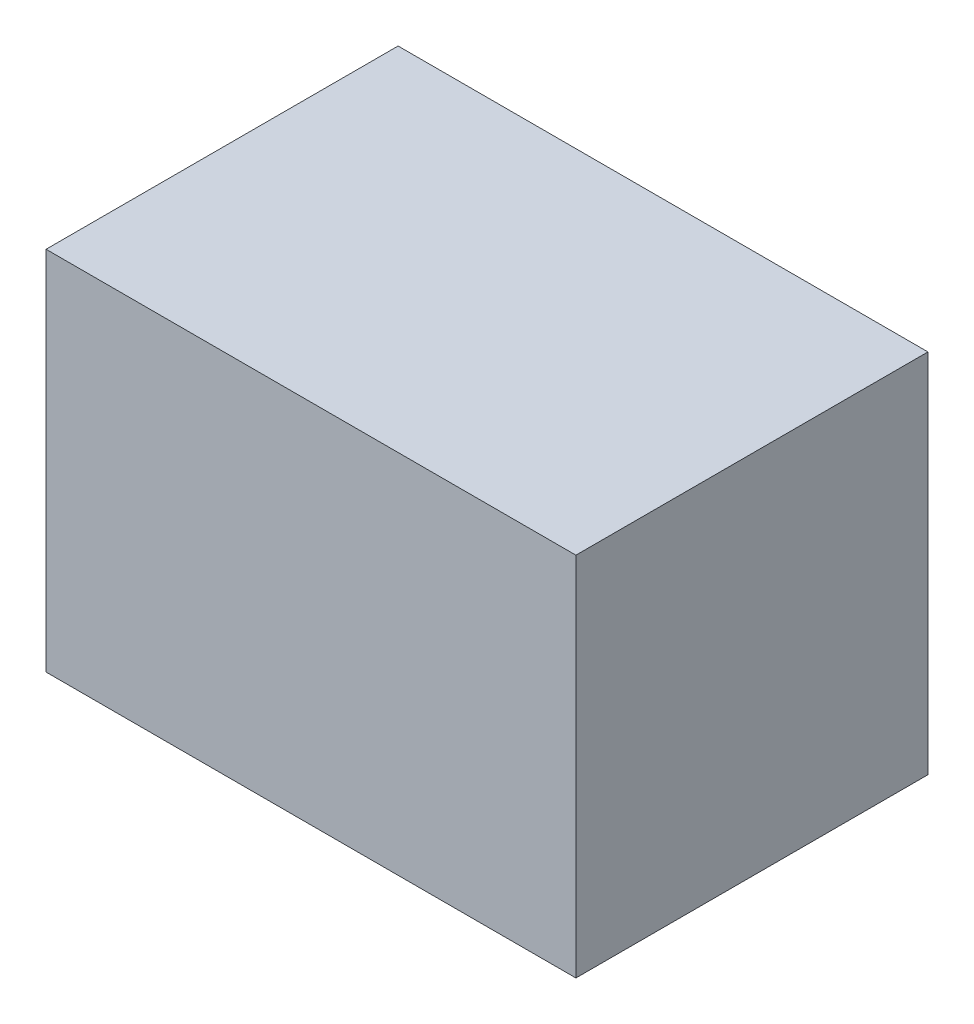
ISO-10303-21;
HEADER;
FILE_DESCRIPTION(('STEP AP214'),'2;1');
FILE_NAME('part.step','',(''),(''),'','','');
FILE_SCHEMA(('AUTOMOTIVE_DESIGN { 1 0 10303 214 1 1 1 1 }'));
ENDSEC;
DATA;
#1=APPLICATION_CONTEXT('core data for automotive mechanical design processes');
#2=APPLICATION_PROTOCOL_DEFINITION('international standard','automotive_design',2000,#1);
#3=PRODUCT_CONTEXT('',#1,'mechanical');
#4=PRODUCT('Part','Part','',(#3));
#5=PRODUCT_RELATED_PRODUCT_CATEGORY('part','',(#4));
#6=PRODUCT_DEFINITION_FORMATION('','',#4);
#7=PRODUCT_DEFINITION_CONTEXT('part definition',#1,'design');
#8=PRODUCT_DEFINITION('design','',#6,#7);
#9=PRODUCT_DEFINITION_SHAPE('','',#8);
#10=(LENGTH_UNIT() NAMED_UNIT(*) SI_UNIT(.MILLI.,.METRE.));
#11=(NAMED_UNIT(*) PLANE_ANGLE_UNIT() SI_UNIT($,.RADIAN.));
#12=(NAMED_UNIT(*) SI_UNIT($,.STERADIAN.) SOLID_ANGLE_UNIT());
#13=UNCERTAINTY_MEASURE_WITH_UNIT(LENGTH_MEASURE(1.E-05),#10,'distance_accuracy_value','');
#14=(GEOMETRIC_REPRESENTATION_CONTEXT(3) GLOBAL_UNCERTAINTY_ASSIGNED_CONTEXT((#13)) GLOBAL_UNIT_ASSIGNED_CONTEXT((#10,
#11,#12)) REPRESENTATION_CONTEXT('',''));
#15=CARTESIAN_POINT('',(0.,0.,0.));
#16=DIRECTION('',(0.,0.,1.));
#17=DIRECTION('',(1.,0.,0.));
#18=AXIS2_PLACEMENT_3D('',#15,#16,#17);
#19=CARTESIAN_POINT('',(45.1527708490236,-31.2059690423754,60.));
#20=DIRECTION('',(-1.,0.,0.));
#21=DIRECTION('',(0.,0.,1.));
#22=AXIS2_PLACEMENT_3D('',#19,#20,#21);
#23=PLANE('',#22);
#24=DIRECTION('',(0.,1.,0.));
#25=VECTOR('',#24,1.);
#26=CARTESIAN_POINT('',(45.1527708490236,-31.2059690423754,0.));
#27=LINE('',#26,#25);
#28=CARTESIAN_POINT('',(45.1527708490236,-31.2059690423754,0.));
#29=VERTEX_POINT('',#28);
#30=CARTESIAN_POINT('',(45.1527708490236,31.2059690423754,0.));
#31=VERTEX_POINT('',#30);
#32=EDGE_CURVE('E98',#29,#31,#27,.T.);
#33=ORIENTED_EDGE('',*,*,#32,.T.);
#34=DIRECTION('',(0.,0.,-1.));
#35=VECTOR('',#34,1.);
#36=CARTESIAN_POINT('',(45.1527708490236,31.2059690423754,60.));
#37=LINE('',#36,#35);
#38=CARTESIAN_POINT('',(45.1527708490236,31.2059690423754,60.));
#39=VERTEX_POINT('',#38);
#40=EDGE_CURVE('E11',#39,#31,#37,.T.);
#41=ORIENTED_EDGE('',*,*,#40,.F.);
#42=DIRECTION('',(0.,1.,0.));
#43=VECTOR('',#42,1.);
#44=CARTESIAN_POINT('',(45.1527708490236,-31.2059690423754,60.));
#45=LINE('',#44,#43);
#46=CARTESIAN_POINT('',(45.1527708490236,-31.2059690423754,60.));
#47=VERTEX_POINT('',#46);
#48=EDGE_CURVE('E86',#47,#39,#45,.T.);
#49=ORIENTED_EDGE('',*,*,#48,.F.);
#50=DIRECTION('',(0.,0.,-1.));
#51=VECTOR('',#50,1.);
#52=CARTESIAN_POINT('',(45.1527708490236,-31.2059690423754,60.));
#53=LINE('',#52,#51);
#54=EDGE_CURVE('E94',#47,#29,#53,.T.);
#55=ORIENTED_EDGE('',*,*,#54,.T.);
#56=EDGE_LOOP('',(#33,#41,#49,#55));
#57=FACE_BOUND('',#56,.T.);
#58=ADVANCED_FACE('F35',(#57),#23,.F.);
#59=CARTESIAN_POINT('',(-45.1527708490236,31.2059690423754,60.));
#60=DIRECTION('',(0.,-1.,0.));
#61=DIRECTION('',(0.,0.,-1.));
#62=AXIS2_PLACEMENT_3D('',#59,#60,#61);
#63=PLANE('',#62);
#64=DIRECTION('',(-1.,0.,0.));
#65=VECTOR('',#64,1.);
#66=CARTESIAN_POINT('',(-45.1527708490236,31.2059690423754,0.));
#67=LINE('',#66,#65);
#68=CARTESIAN_POINT('',(-45.1527708490236,31.2059690423754,0.));
#69=VERTEX_POINT('',#68);
#70=EDGE_CURVE('E90',#31,#69,#67,.T.);
#71=ORIENTED_EDGE('',*,*,#70,.T.);
#72=DIRECTION('',(0.,0.,-1.));
#73=VECTOR('',#72,1.);
#74=CARTESIAN_POINT('',(-45.1527708490236,31.2059690423754,60.));
#75=LINE('',#74,#73);
#76=CARTESIAN_POINT('',(-45.1527708490236,31.2059690423754,60.));
#77=VERTEX_POINT('',#76);
#78=EDGE_CURVE('E43',#77,#69,#75,.T.);
#79=ORIENTED_EDGE('',*,*,#78,.F.);
#80=DIRECTION('',(-1.,0.,0.));
#81=VECTOR('',#80,1.);
#82=CARTESIAN_POINT('',(-45.1527708490236,31.2059690423754,60.));
#83=LINE('',#82,#81);
#84=EDGE_CURVE('E81',#39,#77,#83,.T.);
#85=ORIENTED_EDGE('',*,*,#84,.F.);
#86=ORIENTED_EDGE('',*,*,#40,.T.);
#87=EDGE_LOOP('',(#71,#79,#85,#86));
#88=FACE_BOUND('',#87,.T.);
#89=ADVANCED_FACE('F89',(#88),#63,.F.);
#90=CARTESIAN_POINT('',(-45.1527708490236,-31.2059690423754,60.));
#91=DIRECTION('',(1.,0.,0.));
#92=DIRECTION('',(0.,0.,-1.));
#93=AXIS2_PLACEMENT_3D('',#90,#91,#92);
#94=PLANE('',#93);
#95=DIRECTION('',(0.,-1.,0.));
#96=VECTOR('',#95,1.);
#97=CARTESIAN_POINT('',(-45.1527708490236,-31.2059690423754,0.));
#98=LINE('',#97,#96);
#99=CARTESIAN_POINT('',(-45.1527708490236,-31.2059690423754,0.));
#100=VERTEX_POINT('',#99);
#101=EDGE_CURVE('E68',#69,#100,#98,.T.);
#102=ORIENTED_EDGE('',*,*,#101,.T.);
#103=DIRECTION('',(0.,0.,-1.));
#104=VECTOR('',#103,1.);
#105=CARTESIAN_POINT('',(-45.1527708490236,-31.2059690423754,60.));
#106=LINE('',#105,#104);
#107=CARTESIAN_POINT('',(-45.1527708490236,-31.2059690423754,60.));
#108=VERTEX_POINT('',#107);
#109=EDGE_CURVE('E91',#108,#100,#106,.T.);
#110=ORIENTED_EDGE('',*,*,#109,.F.);
#111=DIRECTION('',(0.,-1.,0.));
#112=VECTOR('',#111,1.);
#113=CARTESIAN_POINT('',(-45.1527708490236,-31.2059690423754,60.));
#114=LINE('',#113,#112);
#115=EDGE_CURVE('E84',#77,#108,#114,.T.);
#116=ORIENTED_EDGE('',*,*,#115,.F.);
#117=ORIENTED_EDGE('',*,*,#78,.T.);
#118=EDGE_LOOP('',(#102,#110,#116,#117));
#119=FACE_BOUND('',#118,.T.);
#120=ADVANCED_FACE('F92',(#119),#94,.F.);
#121=CARTESIAN_POINT('',(-45.1527708490236,-31.2059690423754,60.));
#122=DIRECTION('',(0.,1.,0.));
#123=DIRECTION('',(0.,0.,1.));
#124=AXIS2_PLACEMENT_3D('',#121,#122,#123);
#125=PLANE('',#124);
#126=DIRECTION('',(1.,0.,0.));
#127=VECTOR('',#126,1.);
#128=CARTESIAN_POINT('',(-45.1527708490236,-31.2059690423754,0.));
#129=LINE('',#128,#127);
#130=EDGE_CURVE('E74',#100,#29,#129,.T.);
#131=ORIENTED_EDGE('',*,*,#130,.T.);
#132=ORIENTED_EDGE('',*,*,#54,.F.);
#133=DIRECTION('',(1.,0.,0.));
#134=VECTOR('',#133,1.);
#135=CARTESIAN_POINT('',(-45.1527708490236,-31.2059690423754,60.));
#136=LINE('',#135,#134);
#137=EDGE_CURVE('E51',#108,#47,#136,.T.);
#138=ORIENTED_EDGE('',*,*,#137,.F.);
#139=ORIENTED_EDGE('',*,*,#109,.T.);
#140=EDGE_LOOP('',(#131,#132,#138,#139));
#141=FACE_BOUND('',#140,.T.);
#142=ADVANCED_FACE('F105',(#141),#125,.F.);
#143=CARTESIAN_POINT('',(0.,0.,60.));
#144=DIRECTION('',(0.,0.,-1.));
#145=DIRECTION('',(-1.,0.,0.));
#146=AXIS2_PLACEMENT_3D('',#143,#144,#145);
#147=PLANE('',#146);
#148=ORIENTED_EDGE('',*,*,#48,.T.);
#149=ORIENTED_EDGE('',*,*,#84,.T.);
#150=ORIENTED_EDGE('',*,*,#115,.T.);
#151=ORIENTED_EDGE('',*,*,#137,.T.);
#152=EDGE_LOOP('',(#148,#149,#150,#151));
#153=FACE_BOUND('',#152,.T.);
#154=ADVANCED_FACE('F82',(#153),#147,.F.);
#155=CARTESIAN_POINT('',(0.,0.,0.));
#156=DIRECTION('',(0.,0.,-1.));
#157=DIRECTION('',(-1.,0.,0.));
#158=AXIS2_PLACEMENT_3D('',#155,#156,#157);
#159=PLANE('',#158);
#160=ORIENTED_EDGE('',*,*,#32,.F.);
#161=ORIENTED_EDGE('',*,*,#130,.F.);
#162=ORIENTED_EDGE('',*,*,#101,.F.);
#163=ORIENTED_EDGE('',*,*,#70,.F.);
#164=EDGE_LOOP('',(#160,#161,#162,#163));
#165=FACE_BOUND('',#164,.T.);
#166=ADVANCED_FACE('F108',(#165),#159,.T.);
#167=CLOSED_SHELL('',(#58,#89,#120,#142,#154,#166));
#168=MANIFOLD_SOLID_BREP('B2',#167);
#169=ADVANCED_BREP_SHAPE_REPRESENTATION('',(#18,#168),#14);
#170=SHAPE_DEFINITION_REPRESENTATION(#9,#169);
ENDSEC;
END-ISO-10303-21;
